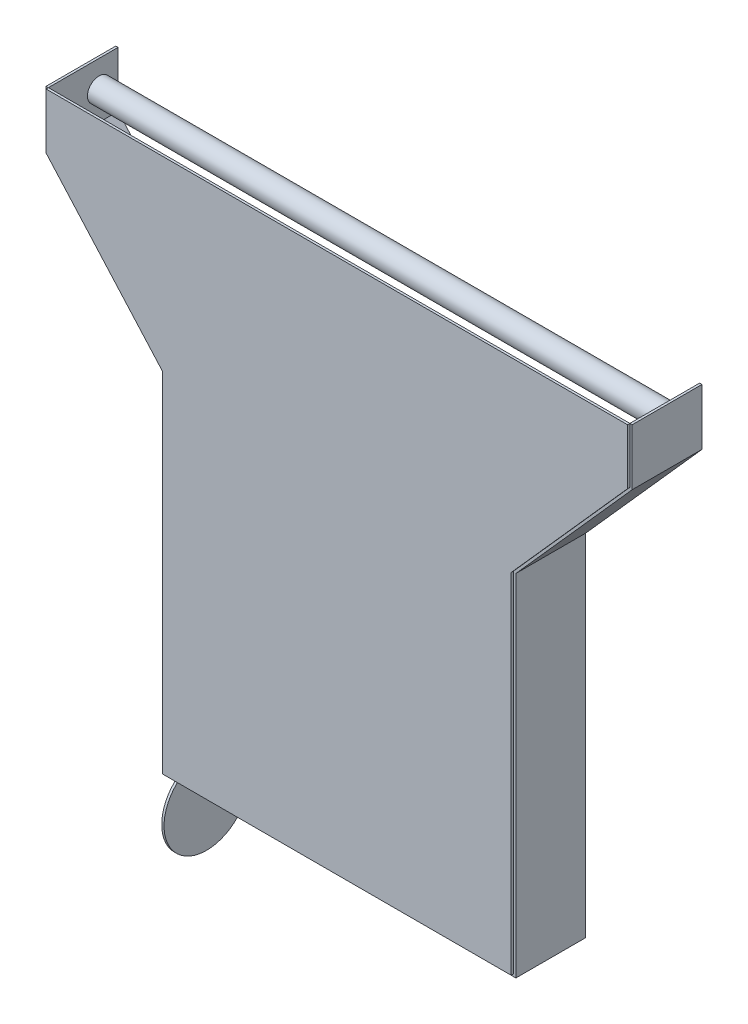
ISO-10303-21;
HEADER;
FILE_DESCRIPTION(('STEP AP214'),'2;1');
FILE_NAME('part.step','',(''),(''),'','','');
FILE_SCHEMA(('AUTOMOTIVE_DESIGN { 1 0 10303 214 1 1 1 1 }'));
ENDSEC;
DATA;
#1=APPLICATION_CONTEXT('core data for automotive mechanical design processes');
#2=APPLICATION_PROTOCOL_DEFINITION('international standard','automotive_design',2000,#1);
#3=PRODUCT_CONTEXT('',#1,'mechanical');
#4=PRODUCT('Part','Part','',(#3));
#5=PRODUCT_RELATED_PRODUCT_CATEGORY('part','',(#4));
#6=PRODUCT_DEFINITION_FORMATION('','',#4);
#7=PRODUCT_DEFINITION_CONTEXT('part definition',#1,'design');
#8=PRODUCT_DEFINITION('design','',#6,#7);
#9=PRODUCT_DEFINITION_SHAPE('','',#8);
#10=(LENGTH_UNIT() NAMED_UNIT(*) SI_UNIT(.MILLI.,.METRE.));
#11=(NAMED_UNIT(*) PLANE_ANGLE_UNIT() SI_UNIT($,.RADIAN.));
#12=(NAMED_UNIT(*) SI_UNIT($,.STERADIAN.) SOLID_ANGLE_UNIT());
#13=UNCERTAINTY_MEASURE_WITH_UNIT(LENGTH_MEASURE(1.E-05),#10,'distance_accuracy_value','');
#14=(GEOMETRIC_REPRESENTATION_CONTEXT(3) GLOBAL_UNCERTAINTY_ASSIGNED_CONTEXT((#13)) GLOBAL_UNIT_ASSIGNED_CONTEXT((#10,
#11,#12)) REPRESENTATION_CONTEXT('',''));
#15=CARTESIAN_POINT('',(0.,0.,0.));
#16=DIRECTION('',(0.,0.,1.));
#17=DIRECTION('',(1.,0.,0.));
#18=AXIS2_PLACEMENT_3D('',#15,#16,#17);
#19=CARTESIAN_POINT('',(-187.96,-530.166171270288,-43.1980143304415));
#20=DIRECTION('',(-1.,0.,0.));
#21=DIRECTION('',(0.,0.,1.));
#22=AXIS2_PLACEMENT_3D('',#19,#20,#21);
#23=CYLINDRICAL_SURFACE('',#22,46.4085760598786);
#24=CARTESIAN_POINT('',(-187.96,-530.166171270288,-43.1980143304415));
#25=DIRECTION('',(1.,0.,0.));
#26=DIRECTION('',(0.,0.,-1.));
#27=AXIS2_PLACEMENT_3D('',#24,#25,#26);
#28=CIRCLE('',#27,46.4085760598786);
#29=CARTESIAN_POINT('',(-187.96,-530.166171270288,-89.6065903903201));
#30=VERTEX_POINT('',#29);
#31=EDGE_CURVE('E11',#30,#30,#28,.T.);
#32=ORIENTED_EDGE('',*,*,#31,.F.);
#33=EDGE_LOOP('',(#32));
#34=FACE_BOUND('',#33,.T.);
#35=CARTESIAN_POINT('',(-190.5,-530.166171270288,-43.1980143304415));
#36=DIRECTION('',(1.,0.,0.));
#37=DIRECTION('',(0.,0.,-1.));
#38=AXIS2_PLACEMENT_3D('',#35,#36,#37);
#39=CIRCLE('',#38,46.4085760598786);
#40=CARTESIAN_POINT('',(-190.5,-530.166171270288,-89.6065903903201));
#41=VERTEX_POINT('',#40);
#42=EDGE_CURVE('E51',#41,#41,#39,.T.);
#43=ORIENTED_EDGE('',*,*,#42,.T.);
#44=EDGE_LOOP('',(#43));
#45=FACE_BOUND('',#44,.T.);
#46=ADVANCED_FACE('F48',(#34,#45),#23,.T.);
#47=CARTESIAN_POINT('',(-187.96,-530.166171270288,-43.1980143304415));
#48=DIRECTION('',(1.,0.,0.));
#49=DIRECTION('',(0.,0.,-1.));
#50=AXIS2_PLACEMENT_3D('',#47,#48,#49);
#51=PLANE('',#50);
#52=ORIENTED_EDGE('',*,*,#31,.T.);
#53=EDGE_LOOP('',(#52));
#54=FACE_BOUND('',#53,.T.);
#55=ADVANCED_FACE('F63',(#54),#51,.T.);
#56=CARTESIAN_POINT('',(-190.5,-530.166171270288,-43.1980143304415));
#57=DIRECTION('',(1.,0.,0.));
#58=DIRECTION('',(0.,0.,-1.));
#59=AXIS2_PLACEMENT_3D('',#56,#57,#58);
#60=PLANE('',#59);
#61=ORIENTED_EDGE('',*,*,#42,.F.);
#62=EDGE_LOOP('',(#61));
#63=FACE_BOUND('',#62,.T.);
#64=ADVANCED_FACE('F61',(#63),#60,.F.);
#65=CLOSED_SHELL('',(#46,#55,#64));
#66=MANIFOLD_SOLID_BREP('B2',#65);
#67=CARTESIAN_POINT('',(-320.04,41.0957822036828,-76.2));
#68=DIRECTION('',(1.,0.,0.));
#69=DIRECTION('',(0.,0.,-1.));
#70=AXIS2_PLACEMENT_3D('',#67,#68,#69);
#71=PLANE('',#70);
#72=DIRECTION('',(0.,1.,0.));
#73=VECTOR('',#72,1.);
#74=CARTESIAN_POINT('',(-320.04,41.0957822036828,0.));
#75=LINE('',#74,#73);
#76=CARTESIAN_POINT('',(-320.04,40.1291698078792,0.));
#77=VERTEX_POINT('',#76);
#78=CARTESIAN_POINT('',(-320.04,101.6,0.));
#79=VERTEX_POINT('',#78);
#80=EDGE_CURVE('E241',#77,#79,#75,.T.);
#81=ORIENTED_EDGE('',*,*,#80,.T.);
#82=DIRECTION('',(0.,0.,1.));
#83=VECTOR('',#82,1.);
#84=CARTESIAN_POINT('',(-320.04,101.6,-76.2));
#85=LINE('',#84,#83);
#86=CARTESIAN_POINT('',(-320.04,101.6,-76.2));
#87=VERTEX_POINT('',#86);
#88=EDGE_CURVE('E46',#87,#79,#85,.T.);
#89=ORIENTED_EDGE('',*,*,#88,.F.);
#90=DIRECTION('',(0.,1.,0.));
#91=VECTOR('',#90,1.);
#92=CARTESIAN_POINT('',(-320.04,41.0957822036828,-76.2));
#93=LINE('',#92,#91);
#94=CARTESIAN_POINT('',(-320.04,40.1291698078792,-76.2));
#95=VERTEX_POINT('',#94);
#96=EDGE_CURVE('E178',#95,#87,#93,.T.);
#97=ORIENTED_EDGE('',*,*,#96,.F.);
#98=DIRECTION('',(0.,0.,1.));
#99=VECTOR('',#98,1.);
#100=CARTESIAN_POINT('',(-320.04,40.1291698078792,-76.2));
#101=LINE('',#100,#99);
#102=EDGE_CURVE('E237',#95,#77,#101,.T.);
#103=ORIENTED_EDGE('',*,*,#102,.T.);
#104=EDGE_LOOP('',(#81,#89,#97,#103));
#105=FACE_BOUND('',#104,.T.);
#106=ADVANCED_FACE('F98',(#105),#71,.F.);
#107=CARTESIAN_POINT('',(-317.5,101.6,-76.2));
#108=DIRECTION('',(0.,1.,0.));
#109=DIRECTION('',(0.,0.,1.));
#110=AXIS2_PLACEMENT_3D('',#107,#108,#109);
#111=PLANE('',#110);
#112=DIRECTION('',(-1.,0.,0.));
#113=VECTOR('',#112,1.);
#114=CARTESIAN_POINT('',(-317.5,101.6,0.));
#115=LINE('',#114,#113);
#116=CARTESIAN_POINT('',(-317.5,101.6,0.));
#117=VERTEX_POINT('',#116);
#118=EDGE_CURVE('E244',#117,#79,#115,.T.);
#119=ORIENTED_EDGE('',*,*,#118,.F.);
#120=DIRECTION('',(0.,0.,1.));
#121=VECTOR('',#120,1.);
#122=CARTESIAN_POINT('',(-317.5,101.6,-76.2));
#123=LINE('',#122,#121);
#124=CARTESIAN_POINT('',(-317.5,101.6,-76.2));
#125=VERTEX_POINT('',#124);
#126=EDGE_CURVE('E106',#125,#117,#123,.T.);
#127=ORIENTED_EDGE('',*,*,#126,.F.);
#128=DIRECTION('',(-1.,0.,0.));
#129=VECTOR('',#128,1.);
#130=CARTESIAN_POINT('',(-317.5,101.6,-76.2));
#131=LINE('',#130,#129);
#132=EDGE_CURVE('E327',#125,#87,#131,.T.);
#133=ORIENTED_EDGE('',*,*,#132,.T.);
#134=ORIENTED_EDGE('',*,*,#88,.T.);
#135=EDGE_LOOP('',(#119,#127,#133,#134));
#136=FACE_BOUND('',#135,.T.);
#137=ADVANCED_FACE('F314',(#136),#111,.T.);
#138=CARTESIAN_POINT('',(-317.5,41.0957822036828,-76.2));
#139=DIRECTION('',(1.,0.,0.));
#140=DIRECTION('',(0.,0.,-1.));
#141=AXIS2_PLACEMENT_3D('',#138,#139,#140);
#142=PLANE('',#141);
#143=CARTESIAN_POINT('',(-317.5,72.2880573320026,-55.3648280675247));
#144=DIRECTION('',(1.,0.,0.));
#145=DIRECTION('',(0.,1.,0.));
#146=AXIS2_PLACEMENT_3D('',#143,#144,#145);
#147=CIRCLE('',#146,12.7);
#148=CARTESIAN_POINT('',(-317.5,84.9880573320026,-55.3648280675247));
#149=VERTEX_POINT('',#148);
#150=EDGE_CURVE('E245',#149,#149,#147,.T.);
#151=ORIENTED_EDGE('',*,*,#150,.F.);
#152=EDGE_LOOP('',(#151));
#153=FACE_BOUND('',#152,.T.);
#154=DIRECTION('',(0.,1.,0.));
#155=VECTOR('',#154,1.);
#156=CARTESIAN_POINT('',(-317.5,41.0957822036828,0.));
#157=LINE('',#156,#155);
#158=CARTESIAN_POINT('',(-317.5,41.0957822036828,0.));
#159=VERTEX_POINT('',#158);
#160=EDGE_CURVE('E248',#159,#117,#157,.T.);
#161=ORIENTED_EDGE('',*,*,#160,.F.);
#162=DIRECTION('',(0.,0.,1.));
#163=VECTOR('',#162,1.);
#164=CARTESIAN_POINT('',(-317.5,41.0957822036828,-76.2));
#165=LINE('',#164,#163);
#166=CARTESIAN_POINT('',(-317.5,41.0957822036828,-76.2));
#167=VERTEX_POINT('',#166);
#168=EDGE_CURVE('E304',#167,#159,#165,.T.);
#169=ORIENTED_EDGE('',*,*,#168,.F.);
#170=DIRECTION('',(0.,1.,0.));
#171=VECTOR('',#170,1.);
#172=CARTESIAN_POINT('',(-317.5,41.0957822036828,-76.2));
#173=LINE('',#172,#171);
#174=EDGE_CURVE('E311',#167,#125,#173,.T.);
#175=ORIENTED_EDGE('',*,*,#174,.T.);
#176=ORIENTED_EDGE('',*,*,#126,.T.);
#177=EDGE_LOOP('',(#161,#169,#175,#176));
#178=FACE_BOUND('',#177,.T.);
#179=ADVANCED_FACE('F309',(#153,#178),#142,.T.);
#180=CARTESIAN_POINT('',(-190.5,-101.6,-76.2));
#181=DIRECTION('',(0.746995078765433,0.664829566355337,0.));
#182=DIRECTION('',(-0.664829566355337,0.746995078765433,0.));
#183=AXIS2_PLACEMENT_3D('',#180,#181,#182);
#184=PLANE('',#183);
#185=DIRECTION('',(-0.664829566355337,0.746995078765433,0.));
#186=VECTOR('',#185,1.);
#187=CARTESIAN_POINT('',(-190.5,-101.6,0.));
#188=LINE('',#187,#186);
#189=CARTESIAN_POINT('',(-190.5,-101.6,0.));
#190=VERTEX_POINT('',#189);
#191=EDGE_CURVE('E251',#190,#159,#188,.T.);
#192=ORIENTED_EDGE('',*,*,#191,.F.);
#193=DIRECTION('',(0.,0.,1.));
#194=VECTOR('',#193,1.);
#195=CARTESIAN_POINT('',(-190.5,-101.6,-76.2));
#196=LINE('',#195,#194);
#197=CARTESIAN_POINT('',(-190.5,-101.6,-76.2));
#198=VERTEX_POINT('',#197);
#199=EDGE_CURVE('E302',#198,#190,#196,.T.);
#200=ORIENTED_EDGE('',*,*,#199,.F.);
#201=DIRECTION('',(-0.664829566355337,0.746995078765433,0.));
#202=VECTOR('',#201,1.);
#203=CARTESIAN_POINT('',(-190.5,-101.6,-76.2));
#204=LINE('',#203,#202);
#205=EDGE_CURVE('E324',#198,#167,#204,.T.);
#206=ORIENTED_EDGE('',*,*,#205,.T.);
#207=ORIENTED_EDGE('',*,*,#168,.T.);
#208=EDGE_LOOP('',(#192,#200,#206,#207));
#209=FACE_BOUND('',#208,.T.);
#210=ADVANCED_FACE('F321',(#209),#184,.T.);
#211=CARTESIAN_POINT('',(-190.5,-482.6,-76.2));
#212=DIRECTION('',(1.,0.,0.));
#213=DIRECTION('',(0.,1.,0.));
#214=AXIS2_PLACEMENT_3D('',#211,#212,#213);
#215=PLANE('',#214);
#216=DIRECTION('',(0.,1.,0.));
#217=VECTOR('',#216,1.);
#218=CARTESIAN_POINT('',(-190.5,-482.6,0.));
#219=LINE('',#218,#217);
#220=CARTESIAN_POINT('',(-190.5,-482.6,0.));
#221=VERTEX_POINT('',#220);
#222=EDGE_CURVE('E254',#221,#190,#219,.T.);
#223=ORIENTED_EDGE('',*,*,#222,.F.);
#224=DIRECTION('',(0.,0.,1.));
#225=VECTOR('',#224,1.);
#226=CARTESIAN_POINT('',(-190.5,-482.6,-76.2));
#227=LINE('',#226,#225);
#228=CARTESIAN_POINT('',(-190.5,-482.6,-76.2));
#229=VERTEX_POINT('',#228);
#230=EDGE_CURVE('E300',#229,#221,#227,.T.);
#231=ORIENTED_EDGE('',*,*,#230,.F.);
#232=DIRECTION('',(0.,1.,0.));
#233=VECTOR('',#232,1.);
#234=CARTESIAN_POINT('',(-190.5,-482.6,-76.2));
#235=LINE('',#234,#233);
#236=EDGE_CURVE('E329',#229,#198,#235,.T.);
#237=ORIENTED_EDGE('',*,*,#236,.T.);
#238=ORIENTED_EDGE('',*,*,#199,.T.);
#239=EDGE_LOOP('',(#223,#231,#237,#238));
#240=FACE_BOUND('',#239,.T.);
#241=ADVANCED_FACE('F387',(#240),#215,.T.);
#242=CARTESIAN_POINT('',(190.5,-482.6,-76.2));
#243=DIRECTION('',(0.,1.,0.));
#244=DIRECTION('',(-1.,0.,0.));
#245=AXIS2_PLACEMENT_3D('',#242,#243,#244);
#246=PLANE('',#245);
#247=DIRECTION('',(-1.,0.,0.));
#248=VECTOR('',#247,1.);
#249=CARTESIAN_POINT('',(190.5,-482.6,0.));
#250=LINE('',#249,#248);
#251=CARTESIAN_POINT('',(190.5,-482.6,0.));
#252=VERTEX_POINT('',#251);
#253=EDGE_CURVE('E257',#252,#221,#250,.T.);
#254=ORIENTED_EDGE('',*,*,#253,.F.);
#255=DIRECTION('',(0.,0.,1.));
#256=VECTOR('',#255,1.);
#257=CARTESIAN_POINT('',(190.5,-482.6,-76.2));
#258=LINE('',#257,#256);
#259=CARTESIAN_POINT('',(190.5,-482.6,-76.2));
#260=VERTEX_POINT('',#259);
#261=EDGE_CURVE('E298',#260,#252,#258,.T.);
#262=ORIENTED_EDGE('',*,*,#261,.F.);
#263=DIRECTION('',(-1.,0.,0.));
#264=VECTOR('',#263,1.);
#265=CARTESIAN_POINT('',(190.5,-482.6,-76.2));
#266=LINE('',#265,#264);
#267=EDGE_CURVE('E335',#260,#229,#266,.T.);
#268=ORIENTED_EDGE('',*,*,#267,.T.);
#269=ORIENTED_EDGE('',*,*,#230,.T.);
#270=EDGE_LOOP('',(#254,#262,#268,#269));
#271=FACE_BOUND('',#270,.T.);
#272=ADVANCED_FACE('F390',(#271),#246,.T.);
#273=CARTESIAN_POINT('',(190.5,-101.6,-76.2));
#274=DIRECTION('',(-1.,0.,0.));
#275=DIRECTION('',(0.,-1.,0.));
#276=AXIS2_PLACEMENT_3D('',#273,#274,#275);
#277=PLANE('',#276);
#278=DIRECTION('',(0.,-1.,0.));
#279=VECTOR('',#278,1.);
#280=CARTESIAN_POINT('',(190.5,-101.6,0.));
#281=LINE('',#280,#279);
#282=CARTESIAN_POINT('',(190.5,-101.6,0.));
#283=VERTEX_POINT('',#282);
#284=EDGE_CURVE('E260',#283,#252,#281,.T.);
#285=ORIENTED_EDGE('',*,*,#284,.F.);
#286=DIRECTION('',(0.,0.,1.));
#287=VECTOR('',#286,1.);
#288=CARTESIAN_POINT('',(190.5,-101.6,-76.2));
#289=LINE('',#288,#287);
#290=CARTESIAN_POINT('',(190.5,-101.6,-76.2));
#291=VERTEX_POINT('',#290);
#292=EDGE_CURVE('E296',#291,#283,#289,.T.);
#293=ORIENTED_EDGE('',*,*,#292,.F.);
#294=DIRECTION('',(0.,-1.,0.));
#295=VECTOR('',#294,1.);
#296=CARTESIAN_POINT('',(190.5,-101.6,-76.2));
#297=LINE('',#296,#295);
#298=EDGE_CURVE('E338',#291,#260,#297,.T.);
#299=ORIENTED_EDGE('',*,*,#298,.T.);
#300=ORIENTED_EDGE('',*,*,#261,.T.);
#301=EDGE_LOOP('',(#285,#293,#299,#300));
#302=FACE_BOUND('',#301,.T.);
#303=ADVANCED_FACE('F394',(#302),#277,.T.);
#304=CARTESIAN_POINT('',(317.5,41.0957822036829,-76.2));
#305=DIRECTION('',(-0.746995078765433,0.664829566355337,0.));
#306=DIRECTION('',(-0.664829566355337,-0.746995078765433,0.));
#307=AXIS2_PLACEMENT_3D('',#304,#305,#306);
#308=PLANE('',#307);
#309=DIRECTION('',(-0.664829566355336,-0.746995078765433,0.));
#310=VECTOR('',#309,1.);
#311=CARTESIAN_POINT('',(317.5,41.0957822036829,0.));
#312=LINE('',#311,#310);
#313=CARTESIAN_POINT('',(317.5,41.0957822036829,0.));
#314=VERTEX_POINT('',#313);
#315=EDGE_CURVE('E263',#314,#283,#312,.T.);
#316=ORIENTED_EDGE('',*,*,#315,.F.);
#317=DIRECTION('',(0.,0.,1.));
#318=VECTOR('',#317,1.);
#319=CARTESIAN_POINT('',(317.5,41.0957822036829,-76.2));
#320=LINE('',#319,#318);
#321=CARTESIAN_POINT('',(317.5,41.0957822036829,-76.2));
#322=VERTEX_POINT('',#321);
#323=EDGE_CURVE('E294',#322,#314,#320,.T.);
#324=ORIENTED_EDGE('',*,*,#323,.F.);
#325=DIRECTION('',(-0.664829566355336,-0.746995078765433,0.));
#326=VECTOR('',#325,1.);
#327=CARTESIAN_POINT('',(317.5,41.0957822036829,-76.2));
#328=LINE('',#327,#326);
#329=EDGE_CURVE('E341',#322,#291,#328,.T.);
#330=ORIENTED_EDGE('',*,*,#329,.T.);
#331=ORIENTED_EDGE('',*,*,#292,.T.);
#332=EDGE_LOOP('',(#316,#324,#330,#331));
#333=FACE_BOUND('',#332,.T.);
#334=ADVANCED_FACE('F398',(#333),#308,.T.);
#335=CARTESIAN_POINT('',(317.5,101.6,-76.2));
#336=DIRECTION('',(-1.,0.,0.));
#337=DIRECTION('',(0.,0.,1.));
#338=AXIS2_PLACEMENT_3D('',#335,#336,#337);
#339=PLANE('',#338);
#340=CARTESIAN_POINT('',(317.5,72.288057332002,-55.3648280675247));
#341=DIRECTION('',(-1.,0.,0.));
#342=DIRECTION('',(0.,0.,1.));
#343=AXIS2_PLACEMENT_3D('',#340,#341,#342);
#344=CIRCLE('',#343,12.7);
#345=CARTESIAN_POINT('',(317.5,72.288057332002,-42.6648280675247));
#346=VERTEX_POINT('',#345);
#347=EDGE_CURVE('E478',#346,#346,#344,.T.);
#348=ORIENTED_EDGE('',*,*,#347,.F.);
#349=EDGE_LOOP('',(#348));
#350=FACE_BOUND('',#349,.T.);
#351=DIRECTION('',(0.,-1.,0.));
#352=VECTOR('',#351,1.);
#353=CARTESIAN_POINT('',(317.5,101.6,0.));
#354=LINE('',#353,#352);
#355=CARTESIAN_POINT('',(317.5,101.6,0.));
#356=VERTEX_POINT('',#355);
#357=EDGE_CURVE('E266',#356,#314,#354,.T.);
#358=ORIENTED_EDGE('',*,*,#357,.F.);
#359=DIRECTION('',(0.,0.,1.));
#360=VECTOR('',#359,1.);
#361=CARTESIAN_POINT('',(317.5,101.6,-76.2));
#362=LINE('',#361,#360);
#363=CARTESIAN_POINT('',(317.5,101.6,-76.2));
#364=VERTEX_POINT('',#363);
#365=EDGE_CURVE('E292',#364,#356,#362,.T.);
#366=ORIENTED_EDGE('',*,*,#365,.F.);
#367=DIRECTION('',(0.,-1.,0.));
#368=VECTOR('',#367,1.);
#369=CARTESIAN_POINT('',(317.5,101.6,-76.2));
#370=LINE('',#369,#368);
#371=EDGE_CURVE('E344',#364,#322,#370,.T.);
#372=ORIENTED_EDGE('',*,*,#371,.T.);
#373=ORIENTED_EDGE('',*,*,#323,.T.);
#374=EDGE_LOOP('',(#358,#366,#372,#373));
#375=FACE_BOUND('',#374,.T.);
#376=ADVANCED_FACE('F402',(#350,#375),#339,.T.);
#377=CARTESIAN_POINT('',(320.04,101.6,-76.2));
#378=DIRECTION('',(0.,1.,0.));
#379=DIRECTION('',(0.,0.,1.));
#380=AXIS2_PLACEMENT_3D('',#377,#378,#379);
#381=PLANE('',#380);
#382=DIRECTION('',(-1.,0.,0.));
#383=VECTOR('',#382,1.);
#384=CARTESIAN_POINT('',(320.04,101.6,0.));
#385=LINE('',#384,#383);
#386=CARTESIAN_POINT('',(320.04,101.6,0.));
#387=VERTEX_POINT('',#386);
#388=EDGE_CURVE('E269',#387,#356,#385,.T.);
#389=ORIENTED_EDGE('',*,*,#388,.F.);
#390=DIRECTION('',(0.,0.,1.));
#391=VECTOR('',#390,1.);
#392=CARTESIAN_POINT('',(320.04,101.6,-76.2));
#393=LINE('',#392,#391);
#394=CARTESIAN_POINT('',(320.04,101.6,-76.2));
#395=VERTEX_POINT('',#394);
#396=EDGE_CURVE('E290',#395,#387,#393,.T.);
#397=ORIENTED_EDGE('',*,*,#396,.F.);
#398=DIRECTION('',(-1.,0.,0.));
#399=VECTOR('',#398,1.);
#400=CARTESIAN_POINT('',(320.04,101.6,-76.2));
#401=LINE('',#400,#399);
#402=EDGE_CURVE('E347',#395,#364,#401,.T.);
#403=ORIENTED_EDGE('',*,*,#402,.T.);
#404=ORIENTED_EDGE('',*,*,#365,.T.);
#405=EDGE_LOOP('',(#389,#397,#403,#404));
#406=FACE_BOUND('',#405,.T.);
#407=ADVANCED_FACE('F406',(#406),#381,.T.);
#408=CARTESIAN_POINT('',(320.04,101.6,-76.2));
#409=DIRECTION('',(-1.,0.,0.));
#410=DIRECTION('',(0.,0.,1.));
#411=AXIS2_PLACEMENT_3D('',#408,#409,#410);
#412=PLANE('',#411);
#413=DIRECTION('',(0.,1.,0.));
#414=VECTOR('',#413,1.);
#415=CARTESIAN_POINT('',(320.04,101.6,0.));
#416=LINE('',#415,#414);
#417=CARTESIAN_POINT('',(320.04,40.1291698078793,0.));
#418=VERTEX_POINT('',#417);
#419=EDGE_CURVE('E272',#387,#418,#416,.F.);
#420=ORIENTED_EDGE('',*,*,#419,.T.);
#421=DIRECTION('',(0.,0.,1.));
#422=VECTOR('',#421,1.);
#423=CARTESIAN_POINT('',(320.04,40.1291698078793,-76.2));
#424=LINE('',#423,#422);
#425=CARTESIAN_POINT('',(320.04,40.1291698078793,-76.2));
#426=VERTEX_POINT('',#425);
#427=EDGE_CURVE('E287',#426,#418,#424,.T.);
#428=ORIENTED_EDGE('',*,*,#427,.F.);
#429=DIRECTION('',(0.,1.,0.));
#430=VECTOR('',#429,1.);
#431=CARTESIAN_POINT('',(320.04,101.6,-76.2));
#432=LINE('',#431,#430);
#433=EDGE_CURVE('E350',#395,#426,#432,.F.);
#434=ORIENTED_EDGE('',*,*,#433,.F.);
#435=ORIENTED_EDGE('',*,*,#396,.T.);
#436=EDGE_LOOP('',(#420,#428,#434,#435));
#437=FACE_BOUND('',#436,.T.);
#438=ADVANCED_FACE('F410',(#437),#412,.F.);
#439=CARTESIAN_POINT('',(319.397367500064,39.4071151051403,-76.2));
#440=DIRECTION('',(-0.746995078765433,0.664829566355336,0.));
#441=DIRECTION('',(-0.664829566355336,-0.746995078765433,0.));
#442=AXIS2_PLACEMENT_3D('',#439,#440,#441);
#443=PLANE('',#442);
#444=DIRECTION('',(-0.664829566355336,-0.746995078765433,0.));
#445=VECTOR('',#444,1.);
#446=CARTESIAN_POINT('',(319.397367500064,39.4071151051403,0.));
#447=LINE('',#446,#445);
#448=CARTESIAN_POINT('',(193.04,-102.566612395804,0.));
#449=VERTEX_POINT('',#448);
#450=EDGE_CURVE('E274',#418,#449,#447,.T.);
#451=ORIENTED_EDGE('',*,*,#450,.T.);
#452=DIRECTION('',(0.,0.,1.));
#453=VECTOR('',#452,1.);
#454=CARTESIAN_POINT('',(193.04,-102.566612395804,-76.2));
#455=LINE('',#454,#453);
#456=CARTESIAN_POINT('',(193.04,-102.566612395804,-76.2));
#457=VERTEX_POINT('',#456);
#458=EDGE_CURVE('E284',#457,#449,#455,.T.);
#459=ORIENTED_EDGE('',*,*,#458,.F.);
#460=DIRECTION('',(-0.664829566355336,-0.746995078765433,0.));
#461=VECTOR('',#460,1.);
#462=CARTESIAN_POINT('',(319.397367500064,39.4071151051403,-76.2));
#463=LINE('',#462,#461);
#464=EDGE_CURVE('E352',#426,#457,#463,.T.);
#465=ORIENTED_EDGE('',*,*,#464,.F.);
#466=ORIENTED_EDGE('',*,*,#427,.T.);
#467=EDGE_LOOP('',(#451,#459,#465,#466));
#468=FACE_BOUND('',#467,.T.);
#469=ADVANCED_FACE('F359',(#468),#443,.F.);
#470=CARTESIAN_POINT('',(193.04,-101.6,-76.2));
#471=DIRECTION('',(-1.,0.,0.));
#472=DIRECTION('',(0.,-1.,0.));
#473=AXIS2_PLACEMENT_3D('',#470,#471,#472);
#474=PLANE('',#473);
#475=DIRECTION('',(0.,-1.,0.));
#476=VECTOR('',#475,1.);
#477=CARTESIAN_POINT('',(193.04,-101.6,0.));
#478=LINE('',#477,#476);
#479=CARTESIAN_POINT('',(193.04,-485.14,0.));
#480=VERTEX_POINT('',#479);
#481=EDGE_CURVE('E276',#449,#480,#478,.T.);
#482=ORIENTED_EDGE('',*,*,#481,.T.);
#483=DIRECTION('',(0.,0.,1.));
#484=VECTOR('',#483,1.);
#485=CARTESIAN_POINT('',(193.04,-485.14,-76.2));
#486=LINE('',#485,#484);
#487=CARTESIAN_POINT('',(193.04,-485.14,-76.2));
#488=VERTEX_POINT('',#487);
#489=EDGE_CURVE('E232',#488,#480,#486,.T.);
#490=ORIENTED_EDGE('',*,*,#489,.F.);
#491=DIRECTION('',(0.,-1.,0.));
#492=VECTOR('',#491,1.);
#493=CARTESIAN_POINT('',(193.04,-101.6,-76.2));
#494=LINE('',#493,#492);
#495=EDGE_CURVE('E223',#457,#488,#494,.T.);
#496=ORIENTED_EDGE('',*,*,#495,.F.);
#497=ORIENTED_EDGE('',*,*,#458,.T.);
#498=EDGE_LOOP('',(#482,#490,#496,#497));
#499=FACE_BOUND('',#498,.T.);
#500=ADVANCED_FACE('F363',(#499),#474,.F.);
#501=CARTESIAN_POINT('',(190.5,-485.14,-76.2));
#502=DIRECTION('',(0.,1.,0.));
#503=DIRECTION('',(-1.,0.,0.));
#504=AXIS2_PLACEMENT_3D('',#501,#502,#503);
#505=PLANE('',#504);
#506=DIRECTION('',(-1.,0.,0.));
#507=VECTOR('',#506,1.);
#508=CARTESIAN_POINT('',(190.5,-485.14,0.));
#509=LINE('',#508,#507);
#510=CARTESIAN_POINT('',(-193.04,-485.14,0.));
#511=VERTEX_POINT('',#510);
#512=EDGE_CURVE('E231',#480,#511,#509,.T.);
#513=ORIENTED_EDGE('',*,*,#512,.T.);
#514=DIRECTION('',(0.,0.,1.));
#515=VECTOR('',#514,1.);
#516=CARTESIAN_POINT('',(-193.04,-485.14,-76.2));
#517=LINE('',#516,#515);
#518=CARTESIAN_POINT('',(-193.04,-485.14,-76.2));
#519=VERTEX_POINT('',#518);
#520=EDGE_CURVE('E228',#519,#511,#517,.T.);
#521=ORIENTED_EDGE('',*,*,#520,.F.);
#522=DIRECTION('',(-1.,0.,0.));
#523=VECTOR('',#522,1.);
#524=CARTESIAN_POINT('',(190.5,-485.14,-76.2));
#525=LINE('',#524,#523);
#526=EDGE_CURVE('E217',#488,#519,#525,.T.);
#527=ORIENTED_EDGE('',*,*,#526,.F.);
#528=ORIENTED_EDGE('',*,*,#489,.T.);
#529=EDGE_LOOP('',(#513,#521,#527,#528));
#530=FACE_BOUND('',#529,.T.);
#531=ADVANCED_FACE('F229',(#530),#505,.F.);
#532=CARTESIAN_POINT('',(-193.04,-482.6,-76.2));
#533=DIRECTION('',(1.,0.,0.));
#534=DIRECTION('',(0.,1.,0.));
#535=AXIS2_PLACEMENT_3D('',#532,#533,#534);
#536=PLANE('',#535);
#537=DIRECTION('',(0.,1.,0.));
#538=VECTOR('',#537,1.);
#539=CARTESIAN_POINT('',(-193.04,-482.6,0.));
#540=LINE('',#539,#538);
#541=CARTESIAN_POINT('',(-193.04,-102.566612395804,0.));
#542=VERTEX_POINT('',#541);
#543=EDGE_CURVE('E166',#511,#542,#540,.T.);
#544=ORIENTED_EDGE('',*,*,#543,.T.);
#545=DIRECTION('',(0.,0.,1.));
#546=VECTOR('',#545,1.);
#547=CARTESIAN_POINT('',(-193.04,-102.566612395804,-76.2));
#548=LINE('',#547,#546);
#549=CARTESIAN_POINT('',(-193.04,-102.566612395804,-76.2));
#550=VERTEX_POINT('',#549);
#551=EDGE_CURVE('E233',#550,#542,#548,.T.);
#552=ORIENTED_EDGE('',*,*,#551,.F.);
#553=DIRECTION('',(0.,1.,0.));
#554=VECTOR('',#553,1.);
#555=CARTESIAN_POINT('',(-193.04,-482.6,-76.2));
#556=LINE('',#555,#554);
#557=EDGE_CURVE('E221',#519,#550,#556,.T.);
#558=ORIENTED_EDGE('',*,*,#557,.F.);
#559=ORIENTED_EDGE('',*,*,#520,.T.);
#560=EDGE_LOOP('',(#544,#552,#558,#559));
#561=FACE_BOUND('',#560,.T.);
#562=ADVANCED_FACE('F235',(#561),#536,.F.);
#563=CARTESIAN_POINT('',(-192.397367500064,-103.288667098543,-76.2));
#564=DIRECTION('',(0.746995078765433,0.664829566355337,0.));
#565=DIRECTION('',(-0.664829566355337,0.746995078765433,0.));
#566=AXIS2_PLACEMENT_3D('',#563,#564,#565);
#567=PLANE('',#566);
#568=DIRECTION('',(-0.664829566355337,0.746995078765433,0.));
#569=VECTOR('',#568,1.);
#570=CARTESIAN_POINT('',(-192.397367500064,-103.288667098543,0.));
#571=LINE('',#570,#569);
#572=EDGE_CURVE('E172',#542,#77,#571,.T.);
#573=ORIENTED_EDGE('',*,*,#572,.T.);
#574=ORIENTED_EDGE('',*,*,#102,.F.);
#575=DIRECTION('',(-0.664829566355337,0.746995078765433,0.));
#576=VECTOR('',#575,1.);
#577=CARTESIAN_POINT('',(-192.397367500064,-103.288667098543,-76.2));
#578=LINE('',#577,#576);
#579=EDGE_CURVE('E114',#550,#95,#578,.T.);
#580=ORIENTED_EDGE('',*,*,#579,.F.);
#581=ORIENTED_EDGE('',*,*,#551,.T.);
#582=EDGE_LOOP('',(#573,#574,#580,#581));
#583=FACE_BOUND('',#582,.T.);
#584=ADVANCED_FACE('F365',(#583),#567,.F.);
#585=CARTESIAN_POINT('',(0.,0.,-76.2));
#586=DIRECTION('',(0.,0.,1.));
#587=DIRECTION('',(1.,0.,0.));
#588=AXIS2_PLACEMENT_3D('',#585,#586,#587);
#589=PLANE('',#588);
#590=ORIENTED_EDGE('',*,*,#96,.T.);
#591=ORIENTED_EDGE('',*,*,#132,.F.);
#592=ORIENTED_EDGE('',*,*,#174,.F.);
#593=ORIENTED_EDGE('',*,*,#205,.F.);
#594=ORIENTED_EDGE('',*,*,#236,.F.);
#595=ORIENTED_EDGE('',*,*,#267,.F.);
#596=ORIENTED_EDGE('',*,*,#298,.F.);
#597=ORIENTED_EDGE('',*,*,#329,.F.);
#598=ORIENTED_EDGE('',*,*,#371,.F.);
#599=ORIENTED_EDGE('',*,*,#402,.F.);
#600=ORIENTED_EDGE('',*,*,#433,.T.);
#601=ORIENTED_EDGE('',*,*,#464,.T.);
#602=ORIENTED_EDGE('',*,*,#495,.T.);
#603=ORIENTED_EDGE('',*,*,#526,.T.);
#604=ORIENTED_EDGE('',*,*,#557,.T.);
#605=ORIENTED_EDGE('',*,*,#579,.T.);
#606=EDGE_LOOP('',(#590,#591,#592,#593,#594,#595,#596,#597,#598,#599,#600,#601,#602,#603,#604,#605));
#607=FACE_BOUND('',#606,.T.);
#608=ADVANCED_FACE('F219',(#607),#589,.F.);
#609=CARTESIAN_POINT('',(0.,0.,0.));
#610=DIRECTION('',(0.,0.,1.));
#611=DIRECTION('',(1.,0.,0.));
#612=AXIS2_PLACEMENT_3D('',#609,#610,#611);
#613=PLANE('',#612);
#614=ORIENTED_EDGE('',*,*,#80,.F.);
#615=ORIENTED_EDGE('',*,*,#572,.F.);
#616=ORIENTED_EDGE('',*,*,#543,.F.);
#617=ORIENTED_EDGE('',*,*,#512,.F.);
#618=ORIENTED_EDGE('',*,*,#481,.F.);
#619=ORIENTED_EDGE('',*,*,#450,.F.);
#620=ORIENTED_EDGE('',*,*,#419,.F.);
#621=ORIENTED_EDGE('',*,*,#388,.T.);
#622=ORIENTED_EDGE('',*,*,#357,.T.);
#623=ORIENTED_EDGE('',*,*,#315,.T.);
#624=ORIENTED_EDGE('',*,*,#284,.T.);
#625=ORIENTED_EDGE('',*,*,#253,.T.);
#626=ORIENTED_EDGE('',*,*,#222,.T.);
#627=ORIENTED_EDGE('',*,*,#191,.T.);
#628=ORIENTED_EDGE('',*,*,#160,.T.);
#629=ORIENTED_EDGE('',*,*,#118,.T.);
#630=EDGE_LOOP('',(#614,#615,#616,#617,#618,#619,#620,#621,#622,#623,#624,#625,#626,#627,#628,#629));
#631=FACE_BOUND('',#630,.T.);
#632=ADVANCED_FACE('F317',(#631),#613,.T.);
#633=CARTESIAN_POINT('',(320.042,72.288057332002,-55.3648280675247));
#634=DIRECTION('',(-1.,0.,0.));
#635=DIRECTION('',(0.,-1.,0.));
#636=AXIS2_PLACEMENT_3D('',#633,#634,#635);
#637=CYLINDRICAL_SURFACE('',#636,12.7);
#638=ORIENTED_EDGE('',*,*,#347,.T.);
#639=EDGE_LOOP('',(#638));
#640=FACE_BOUND('',#639,.T.);
#641=ORIENTED_EDGE('',*,*,#150,.T.);
#642=EDGE_LOOP('',(#641));
#643=FACE_BOUND('',#642,.T.);
#644=ADVANCED_FACE('F447',(#640,#643),#637,.T.);
#645=CLOSED_SHELL('',(#106,#137,#179,#210,#241,#272,#303,#334,#376,#407,#438,#469,#500,#531,
#562,#584,#608,#632,#644));
#646=MANIFOLD_SOLID_BREP('B6',#645);
#647=CARTESIAN_POINT('',(-317.5,-1.73472347597681E-13,2.54));
#648=DIRECTION('',(1.,0.,0.));
#649=DIRECTION('',(0.,1.,0.));
#650=AXIS2_PLACEMENT_3D('',#647,#648,#649);
#651=PLANE('',#650);
#652=DIRECTION('',(0.,-1.,0.));
#653=VECTOR('',#652,1.);
#654=CARTESIAN_POINT('',(-317.5,-1.73472347597681E-13,0.));
#655=LINE('',#654,#653);
#656=CARTESIAN_POINT('',(-317.5,101.6,0.));
#657=VERTEX_POINT('',#656);
#658=CARTESIAN_POINT('',(-317.5,41.0957822036828,0.));
#659=VERTEX_POINT('',#658);
#660=EDGE_CURVE('E652',#657,#659,#655,.T.);
#661=ORIENTED_EDGE('',*,*,#660,.T.);
#662=DIRECTION('',(0.,0.,-1.));
#663=VECTOR('',#662,1.);
#664=CARTESIAN_POINT('',(-317.5,41.0957822036828,2.54));
#665=LINE('',#664,#663);
#666=CARTESIAN_POINT('',(-317.5,41.0957822036828,2.54));
#667=VERTEX_POINT('',#666);
#668=EDGE_CURVE('E96',#667,#659,#665,.T.);
#669=ORIENTED_EDGE('',*,*,#668,.F.);
#670=DIRECTION('',(0.,-1.,0.));
#671=VECTOR('',#670,1.);
#672=CARTESIAN_POINT('',(-317.5,-1.73472347597681E-13,2.54));
#673=LINE('',#672,#671);
#674=CARTESIAN_POINT('',(-317.5,101.6,2.54));
#675=VERTEX_POINT('',#674);
#676=EDGE_CURVE('E671',#675,#667,#673,.T.);
#677=ORIENTED_EDGE('',*,*,#676,.F.);
#678=DIRECTION('',(0.,0.,-1.));
#679=VECTOR('',#678,1.);
#680=CARTESIAN_POINT('',(-317.5,101.6,2.54));
#681=LINE('',#680,#679);
#682=EDGE_CURVE('E571',#675,#657,#681,.T.);
#683=ORIENTED_EDGE('',*,*,#682,.T.);
#684=EDGE_LOOP('',(#661,#669,#677,#683));
#685=FACE_BOUND('',#684,.T.);
#686=ADVANCED_FACE('F555',(#685),#651,.F.);
#687=CARTESIAN_POINT('',(-156.756354378183,-139.513983515032,2.54));
#688=DIRECTION('',(0.746995078765433,0.664829566355337,0.));
#689=DIRECTION('',(-0.664829566355337,0.746995078765433,0.));
#690=AXIS2_PLACEMENT_3D('',#687,#688,#689);
#691=PLANE('',#690);
#692=DIRECTION('',(0.664829566355337,-0.746995078765433,0.));
#693=VECTOR('',#692,1.);
#694=CARTESIAN_POINT('',(-156.756354378183,-139.513983515032,0.));
#695=LINE('',#694,#693);
#696=CARTESIAN_POINT('',(-190.5,-101.6,0.));
#697=VERTEX_POINT('',#696);
#698=EDGE_CURVE('E654',#659,#697,#695,.T.);
#699=ORIENTED_EDGE('',*,*,#698,.T.);
#700=DIRECTION('',(0.,0.,-1.));
#701=VECTOR('',#700,1.);
#702=CARTESIAN_POINT('',(-190.5,-101.6,2.54));
#703=LINE('',#702,#701);
#704=CARTESIAN_POINT('',(-190.5,-101.6,2.54));
#705=VERTEX_POINT('',#704);
#706=EDGE_CURVE('E563',#705,#697,#703,.T.);
#707=ORIENTED_EDGE('',*,*,#706,.F.);
#708=DIRECTION('',(0.664829566355337,-0.746995078765433,0.));
#709=VECTOR('',#708,1.);
#710=CARTESIAN_POINT('',(-156.756354378183,-139.513983515032,2.54));
#711=LINE('',#710,#709);
#712=EDGE_CURVE('E609',#667,#705,#711,.T.);
#713=ORIENTED_EDGE('',*,*,#712,.F.);
#714=ORIENTED_EDGE('',*,*,#668,.T.);
#715=EDGE_LOOP('',(#699,#707,#713,#714));
#716=FACE_BOUND('',#715,.T.);
#717=ADVANCED_FACE('F698',(#716),#691,.F.);
#718=CARTESIAN_POINT('',(-190.5,0.,2.54));
#719=DIRECTION('',(1.,0.,0.));
#720=DIRECTION('',(0.,1.,0.));
#721=AXIS2_PLACEMENT_3D('',#718,#719,#720);
#722=PLANE('',#721);
#723=DIRECTION('',(0.,-1.,0.));
#724=VECTOR('',#723,1.);
#725=CARTESIAN_POINT('',(-190.5,0.,0.));
#726=LINE('',#725,#724);
#727=CARTESIAN_POINT('',(-190.5,-482.6,0.));
#728=VERTEX_POINT('',#727);
#729=EDGE_CURVE('E656',#697,#728,#726,.T.);
#730=ORIENTED_EDGE('',*,*,#729,.T.);
#731=DIRECTION('',(0.,0.,-1.));
#732=VECTOR('',#731,1.);
#733=CARTESIAN_POINT('',(-190.5,-482.6,2.54));
#734=LINE('',#733,#732);
#735=CARTESIAN_POINT('',(-190.5,-482.6,2.54));
#736=VERTEX_POINT('',#735);
#737=EDGE_CURVE('E677',#736,#728,#734,.T.);
#738=ORIENTED_EDGE('',*,*,#737,.F.);
#739=DIRECTION('',(0.,-1.,0.));
#740=VECTOR('',#739,1.);
#741=CARTESIAN_POINT('',(-190.5,0.,2.54));
#742=LINE('',#741,#740);
#743=EDGE_CURVE('E684',#705,#736,#742,.T.);
#744=ORIENTED_EDGE('',*,*,#743,.F.);
#745=ORIENTED_EDGE('',*,*,#706,.T.);
#746=EDGE_LOOP('',(#730,#738,#744,#745));
#747=FACE_BOUND('',#746,.T.);
#748=ADVANCED_FACE('F682',(#747),#722,.F.);
#749=CARTESIAN_POINT('',(0.,-482.6,2.54));
#750=DIRECTION('',(0.,-1.,0.));
#751=DIRECTION('',(1.,0.,0.));
#752=AXIS2_PLACEMENT_3D('',#749,#750,#751);
#753=PLANE('',#752);
#754=DIRECTION('',(-1.,0.,0.));
#755=VECTOR('',#754,1.);
#756=CARTESIAN_POINT('',(0.,-482.6,0.));
#757=LINE('',#756,#755);
#758=CARTESIAN_POINT('',(190.5,-482.6,0.));
#759=VERTEX_POINT('',#758);
#760=EDGE_CURVE('E659',#759,#728,#757,.T.);
#761=ORIENTED_EDGE('',*,*,#760,.F.);
#762=DIRECTION('',(0.,0.,-1.));
#763=VECTOR('',#762,1.);
#764=CARTESIAN_POINT('',(190.5,-482.6,2.54));
#765=LINE('',#764,#763);
#766=CARTESIAN_POINT('',(190.5,-482.6,2.54));
#767=VERTEX_POINT('',#766);
#768=EDGE_CURVE('E675',#767,#759,#765,.T.);
#769=ORIENTED_EDGE('',*,*,#768,.F.);
#770=DIRECTION('',(-1.,0.,0.));
#771=VECTOR('',#770,1.);
#772=CARTESIAN_POINT('',(0.,-482.6,2.54));
#773=LINE('',#772,#771);
#774=EDGE_CURVE('E692',#767,#736,#773,.T.);
#775=ORIENTED_EDGE('',*,*,#774,.T.);
#776=ORIENTED_EDGE('',*,*,#737,.T.);
#777=EDGE_LOOP('',(#761,#769,#775,#776));
#778=FACE_BOUND('',#777,.T.);
#779=ADVANCED_FACE('F690',(#778),#753,.T.);
#780=CARTESIAN_POINT('',(190.5,0.,2.54));
#781=DIRECTION('',(1.,0.,0.));
#782=DIRECTION('',(0.,1.,0.));
#783=AXIS2_PLACEMENT_3D('',#780,#781,#782);
#784=PLANE('',#783);
#785=DIRECTION('',(0.,-1.,0.));
#786=VECTOR('',#785,1.);
#787=CARTESIAN_POINT('',(190.5,0.,0.));
#788=LINE('',#787,#786);
#789=CARTESIAN_POINT('',(190.5,-101.6,0.));
#790=VERTEX_POINT('',#789);
#791=EDGE_CURVE('E662',#790,#759,#788,.T.);
#792=ORIENTED_EDGE('',*,*,#791,.F.);
#793=DIRECTION('',(0.,0.,-1.));
#794=VECTOR('',#793,1.);
#795=CARTESIAN_POINT('',(190.5,-101.6,2.54));
#796=LINE('',#795,#794);
#797=CARTESIAN_POINT('',(190.5,-101.6,2.54));
#798=VERTEX_POINT('',#797);
#799=EDGE_CURVE('E634',#798,#790,#796,.T.);
#800=ORIENTED_EDGE('',*,*,#799,.F.);
#801=DIRECTION('',(0.,-1.,0.));
#802=VECTOR('',#801,1.);
#803=CARTESIAN_POINT('',(190.5,0.,2.54));
#804=LINE('',#803,#802);
#805=EDGE_CURVE('E644',#798,#767,#804,.T.);
#806=ORIENTED_EDGE('',*,*,#805,.T.);
#807=ORIENTED_EDGE('',*,*,#768,.T.);
#808=EDGE_LOOP('',(#792,#800,#806,#807));
#809=FACE_BOUND('',#808,.T.);
#810=ADVANCED_FACE('F708',(#809),#784,.T.);
#811=CARTESIAN_POINT('',(156.756354378183,-139.513983515032,2.54));
#812=DIRECTION('',(0.746995078765433,-0.664829566355337,0.));
#813=DIRECTION('',(0.664829566355337,0.746995078765433,0.));
#814=AXIS2_PLACEMENT_3D('',#811,#812,#813);
#815=PLANE('',#814);
#816=DIRECTION('',(-0.664829566355336,-0.746995078765433,0.));
#817=VECTOR('',#816,1.);
#818=CARTESIAN_POINT('',(156.756354378183,-139.513983515032,0.));
#819=LINE('',#818,#817);
#820=CARTESIAN_POINT('',(317.5,41.0957822036829,0.));
#821=VERTEX_POINT('',#820);
#822=EDGE_CURVE('E630',#821,#790,#819,.T.);
#823=ORIENTED_EDGE('',*,*,#822,.F.);
#824=DIRECTION('',(0.,0.,-1.));
#825=VECTOR('',#824,1.);
#826=CARTESIAN_POINT('',(317.5,41.0957822036829,2.54));
#827=LINE('',#826,#825);
#828=CARTESIAN_POINT('',(317.5,41.0957822036829,2.54));
#829=VERTEX_POINT('',#828);
#830=EDGE_CURVE('E625',#829,#821,#827,.T.);
#831=ORIENTED_EDGE('',*,*,#830,.F.);
#832=DIRECTION('',(-0.664829566355336,-0.746995078765433,0.));
#833=VECTOR('',#832,1.);
#834=CARTESIAN_POINT('',(156.756354378183,-139.513983515032,2.54));
#835=LINE('',#834,#833);
#836=EDGE_CURVE('E628',#829,#798,#835,.T.);
#837=ORIENTED_EDGE('',*,*,#836,.T.);
#838=ORIENTED_EDGE('',*,*,#799,.T.);
#839=EDGE_LOOP('',(#823,#831,#837,#838));
#840=FACE_BOUND('',#839,.T.);
#841=ADVANCED_FACE('F627',(#840),#815,.T.);
#842=CARTESIAN_POINT('',(317.5,-1.73472347597681E-13,2.54));
#843=DIRECTION('',(1.,0.,0.));
#844=DIRECTION('',(0.,1.,0.));
#845=AXIS2_PLACEMENT_3D('',#842,#843,#844);
#846=PLANE('',#845);
#847=DIRECTION('',(0.,-1.,0.));
#848=VECTOR('',#847,1.);
#849=CARTESIAN_POINT('',(317.5,-1.73472347597681E-13,0.));
#850=LINE('',#849,#848);
#851=CARTESIAN_POINT('',(317.5,101.6,0.));
#852=VERTEX_POINT('',#851);
#853=EDGE_CURVE('E666',#852,#821,#850,.T.);
#854=ORIENTED_EDGE('',*,*,#853,.F.);
#855=DIRECTION('',(0.,0.,-1.));
#856=VECTOR('',#855,1.);
#857=CARTESIAN_POINT('',(317.5,101.6,2.54));
#858=LINE('',#857,#856);
#859=CARTESIAN_POINT('',(317.5,101.6,2.54));
#860=VERTEX_POINT('',#859);
#861=EDGE_CURVE('E597',#860,#852,#858,.T.);
#862=ORIENTED_EDGE('',*,*,#861,.F.);
#863=DIRECTION('',(0.,-1.,0.));
#864=VECTOR('',#863,1.);
#865=CARTESIAN_POINT('',(317.5,-1.73472347597681E-13,2.54));
#866=LINE('',#865,#864);
#867=EDGE_CURVE('E641',#860,#829,#866,.T.);
#868=ORIENTED_EDGE('',*,*,#867,.T.);
#869=ORIENTED_EDGE('',*,*,#830,.T.);
#870=EDGE_LOOP('',(#854,#862,#868,#869));
#871=FACE_BOUND('',#870,.T.);
#872=ADVANCED_FACE('F646',(#871),#846,.T.);
#873=CARTESIAN_POINT('',(0.,101.6,2.54));
#874=DIRECTION('',(0.,1.,0.));
#875=DIRECTION('',(-1.,0.,0.));
#876=AXIS2_PLACEMENT_3D('',#873,#874,#875);
#877=PLANE('',#876);
#878=DIRECTION('',(1.,0.,0.));
#879=VECTOR('',#878,1.);
#880=CARTESIAN_POINT('',(0.,101.6,0.));
#881=LINE('',#880,#879);
#882=EDGE_CURVE('E668',#657,#852,#881,.T.);
#883=ORIENTED_EDGE('',*,*,#882,.F.);
#884=ORIENTED_EDGE('',*,*,#682,.F.);
#885=DIRECTION('',(1.,0.,0.));
#886=VECTOR('',#885,1.);
#887=CARTESIAN_POINT('',(0.,101.6,2.54));
#888=LINE('',#887,#886);
#889=EDGE_CURVE('E647',#675,#860,#888,.T.);
#890=ORIENTED_EDGE('',*,*,#889,.T.);
#891=ORIENTED_EDGE('',*,*,#861,.T.);
#892=EDGE_LOOP('',(#883,#884,#890,#891));
#893=FACE_BOUND('',#892,.T.);
#894=ADVANCED_FACE('F716',(#893),#877,.T.);
#895=CARTESIAN_POINT('',(0.,0.,2.54));
#896=DIRECTION('',(0.,0.,1.));
#897=DIRECTION('',(1.,0.,0.));
#898=AXIS2_PLACEMENT_3D('',#895,#896,#897);
#899=PLANE('',#898);
#900=ORIENTED_EDGE('',*,*,#676,.T.);
#901=ORIENTED_EDGE('',*,*,#712,.T.);
#902=ORIENTED_EDGE('',*,*,#743,.T.);
#903=ORIENTED_EDGE('',*,*,#774,.F.);
#904=ORIENTED_EDGE('',*,*,#805,.F.);
#905=ORIENTED_EDGE('',*,*,#836,.F.);
#906=ORIENTED_EDGE('',*,*,#867,.F.);
#907=ORIENTED_EDGE('',*,*,#889,.F.);
#908=EDGE_LOOP('',(#900,#901,#902,#903,#904,#905,#906,#907));
#909=FACE_BOUND('',#908,.T.);
#910=ADVANCED_FACE('F639',(#909),#899,.T.);
#911=CARTESIAN_POINT('',(0.,0.,0.));
#912=DIRECTION('',(0.,0.,1.));
#913=DIRECTION('',(1.,0.,0.));
#914=AXIS2_PLACEMENT_3D('',#911,#912,#913);
#915=PLANE('',#914);
#916=ORIENTED_EDGE('',*,*,#660,.F.);
#917=ORIENTED_EDGE('',*,*,#882,.T.);
#918=ORIENTED_EDGE('',*,*,#853,.T.);
#919=ORIENTED_EDGE('',*,*,#822,.T.);
#920=ORIENTED_EDGE('',*,*,#791,.T.);
#921=ORIENTED_EDGE('',*,*,#760,.T.);
#922=ORIENTED_EDGE('',*,*,#729,.F.);
#923=ORIENTED_EDGE('',*,*,#698,.F.);
#924=EDGE_LOOP('',(#916,#917,#918,#919,#920,#921,#922,#923));
#925=FACE_BOUND('',#924,.T.);
#926=ADVANCED_FACE('F686',(#925),#915,.F.);
#927=CLOSED_SHELL('',(#686,#717,#748,#779,#810,#841,#872,#894,#910,#926));
#928=MANIFOLD_SOLID_BREP('B40',#927);
#929=ADVANCED_BREP_SHAPE_REPRESENTATION('',(#18,#66,#646,#928),#14);
#930=SHAPE_DEFINITION_REPRESENTATION(#9,#929);
ENDSEC;
END-ISO-10303-21;
